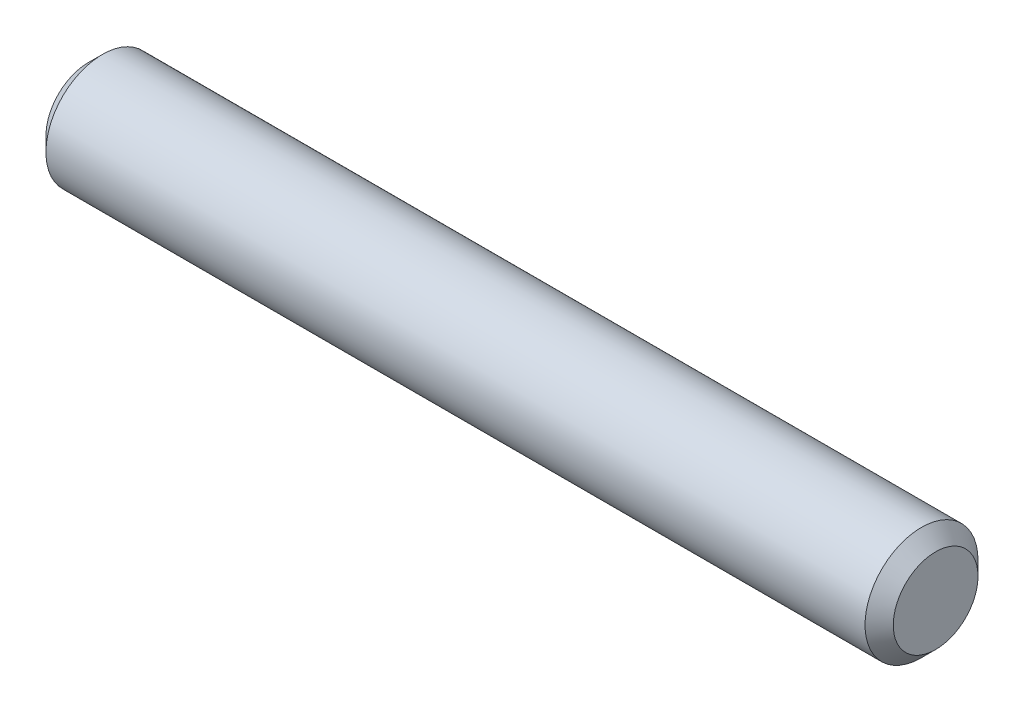
ISO-10303-21;
HEADER;
FILE_DESCRIPTION(('STEP AP214'),'2;1');
FILE_NAME('part.step','',(''),(''),'','','');
FILE_SCHEMA(('AUTOMOTIVE_DESIGN { 1 0 10303 214 1 1 1 1 }'));
ENDSEC;
DATA;
#1=APPLICATION_CONTEXT('core data for automotive mechanical design processes');
#2=APPLICATION_PROTOCOL_DEFINITION('international standard','automotive_design',2000,#1);
#3=PRODUCT_CONTEXT('',#1,'mechanical');
#4=PRODUCT('Part','Part','',(#3));
#5=PRODUCT_RELATED_PRODUCT_CATEGORY('part','',(#4));
#6=PRODUCT_DEFINITION_FORMATION('','',#4);
#7=PRODUCT_DEFINITION_CONTEXT('part definition',#1,'design');
#8=PRODUCT_DEFINITION('design','',#6,#7);
#9=PRODUCT_DEFINITION_SHAPE('','',#8);
#10=(LENGTH_UNIT() NAMED_UNIT(*) SI_UNIT(.MILLI.,.METRE.));
#11=(NAMED_UNIT(*) PLANE_ANGLE_UNIT() SI_UNIT($,.RADIAN.));
#12=(NAMED_UNIT(*) SI_UNIT($,.STERADIAN.) SOLID_ANGLE_UNIT());
#13=UNCERTAINTY_MEASURE_WITH_UNIT(LENGTH_MEASURE(1.E-05),#10,'distance_accuracy_value','');
#14=(GEOMETRIC_REPRESENTATION_CONTEXT(3) GLOBAL_UNCERTAINTY_ASSIGNED_CONTEXT((#13)) GLOBAL_UNIT_ASSIGNED_CONTEXT((#10,
#11,#12)) REPRESENTATION_CONTEXT('',''));
#15=CARTESIAN_POINT('',(0.,0.,0.));
#16=DIRECTION('',(0.,0.,1.));
#17=DIRECTION('',(1.,0.,0.));
#18=AXIS2_PLACEMENT_3D('',#15,#16,#17);
#19=CARTESIAN_POINT('',(15.,0.,0.));
#20=DIRECTION('',(-1.,0.,0.));
#21=DIRECTION('',(0.,0.,1.));
#22=AXIS2_PLACEMENT_3D('',#19,#20,#21);
#23=CYLINDRICAL_SURFACE('',#22,2.);
#24=CARTESIAN_POINT('',(14.5,0.,0.));
#25=DIRECTION('',(1.,0.,0.));
#26=DIRECTION('',(0.,0.,-1.));
#27=AXIS2_PLACEMENT_3D('',#24,#25,#26);
#28=CIRCLE('',#27,2.);
#29=CARTESIAN_POINT('',(14.5,0.,-2.));
#30=VERTEX_POINT('',#29);
#31=EDGE_CURVE('E50',#30,#30,#28,.F.);
#32=ORIENTED_EDGE('',*,*,#31,.T.);
#33=EDGE_LOOP('',(#32));
#34=FACE_BOUND('',#33,.T.);
#35=CARTESIAN_POINT('',(-14.5,0.,0.));
#36=DIRECTION('',(1.,0.,0.));
#37=DIRECTION('',(0.,0.,-1.));
#38=AXIS2_PLACEMENT_3D('',#35,#36,#37);
#39=CIRCLE('',#38,2.);
#40=CARTESIAN_POINT('',(-14.5,0.,-2.));
#41=VERTEX_POINT('',#40);
#42=EDGE_CURVE('E55',#41,#41,#39,.T.);
#43=ORIENTED_EDGE('',*,*,#42,.T.);
#44=EDGE_LOOP('',(#43));
#45=FACE_BOUND('',#44,.T.);
#46=ADVANCED_FACE('F41',(#34,#45),#23,.T.);
#47=CARTESIAN_POINT('',(15.,0.,0.));
#48=DIRECTION('',(1.,0.,0.));
#49=DIRECTION('',(0.,0.,-1.));
#50=AXIS2_PLACEMENT_3D('',#47,#48,#49);
#51=PLANE('',#50);
#52=CARTESIAN_POINT('',(15.,0.,0.));
#53=DIRECTION('',(1.,0.,0.));
#54=DIRECTION('',(0.,0.,-1.));
#55=AXIS2_PLACEMENT_3D('',#52,#53,#54);
#56=CIRCLE('',#55,1.5);
#57=CARTESIAN_POINT('',(15.,0.,-1.5));
#58=VERTEX_POINT('',#57);
#59=EDGE_CURVE('E60',#58,#58,#56,.T.);
#60=ORIENTED_EDGE('',*,*,#59,.T.);
#61=EDGE_LOOP('',(#60));
#62=FACE_BOUND('',#61,.T.);
#63=ADVANCED_FACE('F67',(#62),#51,.T.);
#64=CARTESIAN_POINT('',(-15.,0.,0.));
#65=DIRECTION('',(1.,0.,0.));
#66=DIRECTION('',(0.,0.,-1.));
#67=AXIS2_PLACEMENT_3D('',#64,#65,#66);
#68=PLANE('',#67);
#69=CARTESIAN_POINT('',(-15.,0.,0.));
#70=DIRECTION('',(1.,0.,0.));
#71=DIRECTION('',(0.,0.,-1.));
#72=AXIS2_PLACEMENT_3D('',#69,#70,#71);
#73=CIRCLE('',#72,1.5);
#74=CARTESIAN_POINT('',(-15.,0.,-1.5));
#75=VERTEX_POINT('',#74);
#76=EDGE_CURVE('E10',#75,#75,#73,.F.);
#77=ORIENTED_EDGE('',*,*,#76,.T.);
#78=EDGE_LOOP('',(#77));
#79=FACE_BOUND('',#78,.T.);
#80=ADVANCED_FACE('F71',(#79),#68,.F.);
#81=CARTESIAN_POINT('',(15.,0.,0.));
#82=DIRECTION('',(-1.,0.,0.));
#83=DIRECTION('',(0.,0.,1.));
#84=AXIS2_PLACEMENT_3D('',#81,#82,#83);
#85=CONICAL_SURFACE('',#84,1.5,0.785398163397448);
#86=ORIENTED_EDGE('',*,*,#31,.F.);
#87=EDGE_LOOP('',(#86));
#88=FACE_BOUND('',#87,.T.);
#89=ORIENTED_EDGE('',*,*,#59,.F.);
#90=EDGE_LOOP('',(#89));
#91=FACE_BOUND('',#90,.T.);
#92=ADVANCED_FACE('F69',(#88,#91),#85,.T.);
#93=CARTESIAN_POINT('',(-14.5,0.,0.));
#94=DIRECTION('',(1.,0.,0.));
#95=DIRECTION('',(0.,0.,-1.));
#96=AXIS2_PLACEMENT_3D('',#93,#94,#95);
#97=CONICAL_SURFACE('',#96,2.,0.78539816339745);
#98=ORIENTED_EDGE('',*,*,#76,.F.);
#99=EDGE_LOOP('',(#98));
#100=FACE_BOUND('',#99,.T.);
#101=ORIENTED_EDGE('',*,*,#42,.F.);
#102=EDGE_LOOP('',(#101));
#103=FACE_BOUND('',#102,.T.);
#104=ADVANCED_FACE('F44',(#100,#103),#97,.T.);
#105=CLOSED_SHELL('',(#46,#63,#80,#92,#104));
#106=MANIFOLD_SOLID_BREP('B2',#105);
#107=ADVANCED_BREP_SHAPE_REPRESENTATION('',(#18,#106),#14);
#108=SHAPE_DEFINITION_REPRESENTATION(#9,#107);
ENDSEC;
END-ISO-10303-21;
